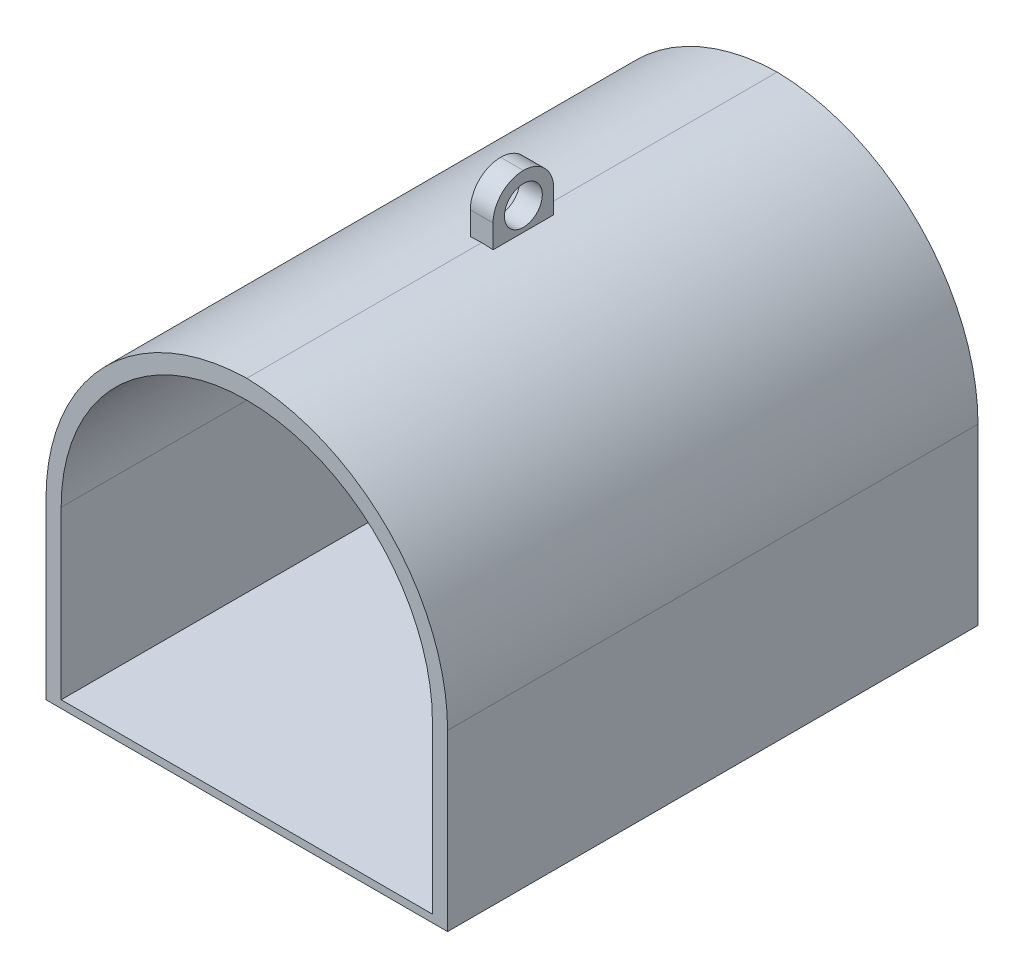
ISO-10303-21;
HEADER;
FILE_DESCRIPTION(('STEP AP214'),'2;1');
FILE_NAME('part.step','',(''),(''),'','','');
FILE_SCHEMA(('AUTOMOTIVE_DESIGN { 1 0 10303 214 1 1 1 1 }'));
ENDSEC;
DATA;
#1=APPLICATION_CONTEXT('core data for automotive mechanical design processes');
#2=APPLICATION_PROTOCOL_DEFINITION('international standard','automotive_design',2000,#1);
#3=PRODUCT_CONTEXT('',#1,'mechanical');
#4=PRODUCT('Part','Part','',(#3));
#5=PRODUCT_RELATED_PRODUCT_CATEGORY('part','',(#4));
#6=PRODUCT_DEFINITION_FORMATION('','',#4);
#7=PRODUCT_DEFINITION_CONTEXT('part definition',#1,'design');
#8=PRODUCT_DEFINITION('design','',#6,#7);
#9=PRODUCT_DEFINITION_SHAPE('','',#8);
#10=(LENGTH_UNIT() NAMED_UNIT(*) SI_UNIT(.MILLI.,.METRE.));
#11=(NAMED_UNIT(*) PLANE_ANGLE_UNIT() SI_UNIT($,.RADIAN.));
#12=(NAMED_UNIT(*) SI_UNIT($,.STERADIAN.) SOLID_ANGLE_UNIT());
#13=UNCERTAINTY_MEASURE_WITH_UNIT(LENGTH_MEASURE(1.E-05),#10,'distance_accuracy_value','');
#14=(GEOMETRIC_REPRESENTATION_CONTEXT(3) GLOBAL_UNCERTAINTY_ASSIGNED_CONTEXT((#13)) GLOBAL_UNIT_ASSIGNED_CONTEXT((#10,
#11,#12)) REPRESENTATION_CONTEXT('',''));
#15=CARTESIAN_POINT('',(0.,0.,0.));
#16=DIRECTION('',(0.,0.,1.));
#17=DIRECTION('',(1.,0.,0.));
#18=AXIS2_PLACEMENT_3D('',#15,#16,#17);
#19=CARTESIAN_POINT('',(0.,0.,70.));
#20=DIRECTION('',(1.,0.,0.));
#21=DIRECTION('',(0.,0.,-1.));
#22=AXIS2_PLACEMENT_3D('',#19,#20,#21);
#23=PLANE('',#22);
#24=DIRECTION('',(0.,-1.,0.));
#25=VECTOR('',#24,1.);
#26=CARTESIAN_POINT('',(0.,0.,70.));
#27=LINE('',#26,#25);
#28=CARTESIAN_POINT('',(0.,23.,70.));
#29=VERTEX_POINT('',#28);
#30=CARTESIAN_POINT('',(0.,0.,70.));
#31=VERTEX_POINT('',#30);
#32=EDGE_CURVE('E202',#29,#31,#27,.T.);
#33=ORIENTED_EDGE('',*,*,#32,.F.);
#34=DIRECTION('',(0.,0.,-1.));
#35=VECTOR('',#34,1.);
#36=CARTESIAN_POINT('',(0.,23.,70.));
#37=LINE('',#36,#35);
#38=CARTESIAN_POINT('',(0.,23.,0.));
#39=VERTEX_POINT('',#38);
#40=EDGE_CURVE('E233',#29,#39,#37,.T.);
#41=ORIENTED_EDGE('',*,*,#40,.T.);
#42=DIRECTION('',(0.,-1.,0.));
#43=VECTOR('',#42,1.);
#44=CARTESIAN_POINT('',(0.,0.,0.));
#45=LINE('',#44,#43);
#46=CARTESIAN_POINT('',(0.,0.,0.));
#47=VERTEX_POINT('',#46);
#48=EDGE_CURVE('E201',#39,#47,#45,.T.);
#49=ORIENTED_EDGE('',*,*,#48,.T.);
#50=DIRECTION('',(0.,0.,-1.));
#51=VECTOR('',#50,1.);
#52=CARTESIAN_POINT('',(0.,0.,70.));
#53=LINE('',#52,#51);
#54=EDGE_CURVE('E218',#31,#47,#53,.T.);
#55=ORIENTED_EDGE('',*,*,#54,.F.);
#56=EDGE_LOOP('',(#33,#41,#49,#55));
#57=FACE_BOUND('',#56,.T.);
#58=ADVANCED_FACE('F39',(#57),#23,.F.);
#59=CARTESIAN_POINT('',(0.,0.,70.));
#60=DIRECTION('',(0.,1.,0.));
#61=DIRECTION('',(0.,0.,1.));
#62=AXIS2_PLACEMENT_3D('',#59,#60,#61);
#63=PLANE('',#62);
#64=DIRECTION('',(1.,0.,0.));
#65=VECTOR('',#64,1.);
#66=CARTESIAN_POINT('',(0.,0.,0.));
#67=LINE('',#66,#65);
#68=CARTESIAN_POINT('',(53.,0.,0.));
#69=VERTEX_POINT('',#68);
#70=EDGE_CURVE('E212',#47,#69,#67,.T.);
#71=ORIENTED_EDGE('',*,*,#70,.T.);
#72=DIRECTION('',(0.,0.,-1.));
#73=VECTOR('',#72,1.);
#74=CARTESIAN_POINT('',(53.,0.,70.));
#75=LINE('',#74,#73);
#76=CARTESIAN_POINT('',(53.,0.,70.));
#77=VERTEX_POINT('',#76);
#78=EDGE_CURVE('E210',#77,#69,#75,.T.);
#79=ORIENTED_EDGE('',*,*,#78,.F.);
#80=DIRECTION('',(1.,0.,0.));
#81=VECTOR('',#80,1.);
#82=CARTESIAN_POINT('',(0.,0.,70.));
#83=LINE('',#82,#81);
#84=EDGE_CURVE('E204',#31,#77,#83,.T.);
#85=ORIENTED_EDGE('',*,*,#84,.F.);
#86=ORIENTED_EDGE('',*,*,#54,.T.);
#87=EDGE_LOOP('',(#71,#79,#85,#86));
#88=FACE_BOUND('',#87,.T.);
#89=ADVANCED_FACE('F287',(#88),#63,.F.);
#90=CARTESIAN_POINT('',(53.,0.,70.));
#91=DIRECTION('',(-1.,0.,0.));
#92=DIRECTION('',(0.,0.,1.));
#93=AXIS2_PLACEMENT_3D('',#90,#91,#92);
#94=PLANE('',#93);
#95=DIRECTION('',(0.,1.,0.));
#96=VECTOR('',#95,1.);
#97=CARTESIAN_POINT('',(53.,0.,0.));
#98=LINE('',#97,#96);
#99=CARTESIAN_POINT('',(53.,23.,0.));
#100=VERTEX_POINT('',#99);
#101=EDGE_CURVE('E205',#69,#100,#98,.T.);
#102=ORIENTED_EDGE('',*,*,#101,.T.);
#103=DIRECTION('',(0.,0.,-1.));
#104=VECTOR('',#103,1.);
#105=CARTESIAN_POINT('',(53.,23.,70.));
#106=LINE('',#105,#104);
#107=CARTESIAN_POINT('',(53.,23.,70.));
#108=VERTEX_POINT('',#107);
#109=EDGE_CURVE('E246',#100,#108,#106,.F.);
#110=ORIENTED_EDGE('',*,*,#109,.T.);
#111=DIRECTION('',(0.,1.,0.));
#112=VECTOR('',#111,1.);
#113=CARTESIAN_POINT('',(53.,0.,70.));
#114=LINE('',#113,#112);
#115=EDGE_CURVE('E207',#77,#108,#114,.T.);
#116=ORIENTED_EDGE('',*,*,#115,.F.);
#117=ORIENTED_EDGE('',*,*,#78,.T.);
#118=EDGE_LOOP('',(#102,#110,#116,#117));
#119=FACE_BOUND('',#118,.T.);
#120=ADVANCED_FACE('F282',(#119),#94,.F.);
#121=CARTESIAN_POINT('',(0.,0.,70.));
#122=DIRECTION('',(0.,0.,-1.));
#123=DIRECTION('',(-1.,0.,0.));
#124=AXIS2_PLACEMENT_3D('',#121,#122,#123);
#125=PLANE('',#124);
#126=DIRECTION('',(1.,0.,0.));
#127=VECTOR('',#126,1.);
#128=CARTESIAN_POINT('',(2.,1.,70.));
#129=LINE('',#128,#127);
#130=CARTESIAN_POINT('',(2.,1.,70.));
#131=VERTEX_POINT('',#130);
#132=CARTESIAN_POINT('',(51.,1.,70.));
#133=VERTEX_POINT('',#132);
#134=EDGE_CURVE('E177',#131,#133,#129,.T.);
#135=ORIENTED_EDGE('',*,*,#134,.F.);
#136=DIRECTION('',(0.,-1.,0.));
#137=VECTOR('',#136,1.);
#138=CARTESIAN_POINT('',(2.,1.,70.));
#139=LINE('',#138,#137);
#140=CARTESIAN_POINT('',(2.,23.,70.));
#141=VERTEX_POINT('',#140);
#142=EDGE_CURVE('E56',#141,#131,#139,.T.);
#143=ORIENTED_EDGE('',*,*,#142,.F.);
#144=CARTESIAN_POINT('',(26.5,23.,70.));
#145=DIRECTION('',(0.,0.,1.));
#146=DIRECTION('',(-1.,0.,0.));
#147=AXIS2_PLACEMENT_3D('',#144,#145,#146);
#148=CIRCLE('',#147,24.5);
#149=CARTESIAN_POINT('',(51.,23.,70.));
#150=VERTEX_POINT('',#149);
#151=EDGE_CURVE('E168',#150,#141,#148,.T.);
#152=ORIENTED_EDGE('',*,*,#151,.F.);
#153=DIRECTION('',(0.,1.,0.));
#154=VECTOR('',#153,1.);
#155=CARTESIAN_POINT('',(51.,1.,70.));
#156=LINE('',#155,#154);
#157=EDGE_CURVE('E171',#133,#150,#156,.T.);
#158=ORIENTED_EDGE('',*,*,#157,.F.);
#159=EDGE_LOOP('',(#135,#143,#152,#158));
#160=FACE_BOUND('',#159,.T.);
#161=CARTESIAN_POINT('',(26.,23.,70.));
#162=DIRECTION('',(0.,0.,-1.));
#163=DIRECTION('',(-1.,0.,0.));
#164=AXIS2_PLACEMENT_3D('',#161,#162,#163);
#165=CIRCLE('',#164,27.);
#166=CARTESIAN_POINT('',(26.5,49.9953699733862,70.));
#167=VERTEX_POINT('',#166);
#168=EDGE_CURVE('E242',#108,#167,#165,.F.);
#169=ORIENTED_EDGE('',*,*,#168,.T.);
#170=CARTESIAN_POINT('',(27.,23.,70.));
#171=DIRECTION('',(0.,0.,-1.));
#172=DIRECTION('',(-1.,0.,0.));
#173=AXIS2_PLACEMENT_3D('',#170,#171,#172);
#174=CIRCLE('',#173,27.);
#175=EDGE_CURVE('E244',#167,#29,#174,.F.);
#176=ORIENTED_EDGE('',*,*,#175,.T.);
#177=ORIENTED_EDGE('',*,*,#32,.T.);
#178=ORIENTED_EDGE('',*,*,#84,.T.);
#179=ORIENTED_EDGE('',*,*,#115,.T.);
#180=EDGE_LOOP('',(#169,#176,#177,#178,#179));
#181=FACE_BOUND('',#180,.T.);
#182=ADVANCED_FACE('F292',(#160,#181),#125,.F.);
#183=CARTESIAN_POINT('',(0.,0.,0.));
#184=DIRECTION('',(0.,0.,-1.));
#185=DIRECTION('',(-1.,0.,0.));
#186=AXIS2_PLACEMENT_3D('',#183,#184,#185);
#187=PLANE('',#186);
#188=ORIENTED_EDGE('',*,*,#48,.F.);
#189=CARTESIAN_POINT('',(27.,23.,0.));
#190=DIRECTION('',(0.,0.,-1.));
#191=DIRECTION('',(-1.,0.,0.));
#192=AXIS2_PLACEMENT_3D('',#189,#190,#191);
#193=CIRCLE('',#192,27.);
#194=CARTESIAN_POINT('',(26.5,49.9953699733862,0.));
#195=VERTEX_POINT('',#194);
#196=EDGE_CURVE('E240',#39,#195,#193,.T.);
#197=ORIENTED_EDGE('',*,*,#196,.T.);
#198=CARTESIAN_POINT('',(26.,23.,0.));
#199=DIRECTION('',(0.,0.,-1.));
#200=DIRECTION('',(-1.,0.,0.));
#201=AXIS2_PLACEMENT_3D('',#198,#199,#200);
#202=CIRCLE('',#201,27.);
#203=EDGE_CURVE('E238',#195,#100,#202,.T.);
#204=ORIENTED_EDGE('',*,*,#203,.T.);
#205=ORIENTED_EDGE('',*,*,#101,.F.);
#206=ORIENTED_EDGE('',*,*,#70,.F.);
#207=EDGE_LOOP('',(#188,#197,#204,#205,#206));
#208=FACE_BOUND('',#207,.T.);
#209=ADVANCED_FACE('F279',(#208),#187,.T.);
#210=CARTESIAN_POINT('',(28.,57.,39.));
#211=DIRECTION('',(-1.,0.,0.));
#212=DIRECTION('',(0.,0.,1.));
#213=AXIS2_PLACEMENT_3D('',#210,#211,#212);
#214=PLANE('',#213);
#215=CARTESIAN_POINT('',(28.,53.,35.));
#216=DIRECTION('',(-1.,0.,0.));
#217=DIRECTION('',(0.,0.,1.));
#218=AXIS2_PLACEMENT_3D('',#215,#216,#217);
#219=CIRCLE('',#218,2.5);
#220=CARTESIAN_POINT('',(28.,53.,37.5));
#221=VERTEX_POINT('',#220);
#222=EDGE_CURVE('E189',#221,#221,#219,.T.);
#223=ORIENTED_EDGE('',*,*,#222,.T.);
#224=EDGE_LOOP('',(#223));
#225=FACE_BOUND('',#224,.T.);
#226=DIRECTION('',(0.,-1.,0.));
#227=VECTOR('',#226,1.);
#228=CARTESIAN_POINT('',(28.,57.,31.));
#229=LINE('',#228,#227);
#230=CARTESIAN_POINT('',(28.,53.,31.));
#231=VERTEX_POINT('',#230);
#232=CARTESIAN_POINT('',(28.,49.9258240356725,31.));
#233=VERTEX_POINT('',#232);
#234=EDGE_CURVE('E63',#231,#233,#229,.T.);
#235=ORIENTED_EDGE('',*,*,#234,.F.);
#236=CARTESIAN_POINT('',(28.,53.,35.));
#237=DIRECTION('',(-1.,0.,0.));
#238=DIRECTION('',(0.,0.,1.));
#239=AXIS2_PLACEMENT_3D('',#236,#237,#238);
#240=CIRCLE('',#239,4.);
#241=CARTESIAN_POINT('',(28.,57.,35.));
#242=VERTEX_POINT('',#241);
#243=EDGE_CURVE('E229',#231,#242,#240,.F.);
#244=ORIENTED_EDGE('',*,*,#243,.T.);
#245=CARTESIAN_POINT('',(28.,53.,35.));
#246=DIRECTION('',(-1.,0.,0.));
#247=DIRECTION('',(0.,0.,1.));
#248=AXIS2_PLACEMENT_3D('',#245,#246,#247);
#249=CIRCLE('',#248,4.);
#250=CARTESIAN_POINT('',(28.,53.,39.));
#251=VERTEX_POINT('',#250);
#252=EDGE_CURVE('E227',#242,#251,#249,.F.);
#253=ORIENTED_EDGE('',*,*,#252,.T.);
#254=DIRECTION('',(0.,-1.,0.));
#255=VECTOR('',#254,1.);
#256=CARTESIAN_POINT('',(28.,57.,39.));
#257=LINE('',#256,#255);
#258=CARTESIAN_POINT('',(28.,49.9258240356725,39.));
#259=VERTEX_POINT('',#258);
#260=EDGE_CURVE('E193',#251,#259,#257,.T.);
#261=ORIENTED_EDGE('',*,*,#260,.T.);
#262=DIRECTION('',(0.,0.,-1.));
#263=VECTOR('',#262,1.);
#264=CARTESIAN_POINT('',(28.,49.9258240356725,39.));
#265=LINE('',#264,#263);
#266=EDGE_CURVE('E48',#259,#233,#265,.T.);
#267=ORIENTED_EDGE('',*,*,#266,.T.);
#268=EDGE_LOOP('',(#235,#244,#253,#261,#267));
#269=FACE_BOUND('',#268,.T.);
#270=ADVANCED_FACE('F309',(#225,#269),#214,.F.);
#271=CARTESIAN_POINT('',(25.,57.,31.));
#272=DIRECTION('',(0.,0.,1.));
#273=DIRECTION('',(1.,0.,0.));
#274=AXIS2_PLACEMENT_3D('',#271,#272,#273);
#275=PLANE('',#274);
#276=DIRECTION('',(0.,-1.,0.));
#277=VECTOR('',#276,1.);
#278=CARTESIAN_POINT('',(25.,57.,31.));
#279=LINE('',#278,#277);
#280=CARTESIAN_POINT('',(25.,53.,31.));
#281=VERTEX_POINT('',#280);
#282=CARTESIAN_POINT('',(25.,49.9258240356725,31.));
#283=VERTEX_POINT('',#282);
#284=EDGE_CURVE('E198',#281,#283,#279,.T.);
#285=ORIENTED_EDGE('',*,*,#284,.F.);
#286=DIRECTION('',(-1.,0.,0.));
#287=VECTOR('',#286,1.);
#288=CARTESIAN_POINT('',(25.,53.,31.));
#289=LINE('',#288,#287);
#290=EDGE_CURVE('E225',#281,#231,#289,.F.);
#291=ORIENTED_EDGE('',*,*,#290,.T.);
#292=ORIENTED_EDGE('',*,*,#234,.T.);
#293=CARTESIAN_POINT('',(26.,23.,31.));
#294=DIRECTION('',(0.,0.,1.));
#295=DIRECTION('',(1.,0.,0.));
#296=AXIS2_PLACEMENT_3D('',#293,#294,#295);
#297=CIRCLE('',#296,27.);
#298=CARTESIAN_POINT('',(26.5,49.9953699733862,31.));
#299=VERTEX_POINT('',#298);
#300=EDGE_CURVE('E11',#233,#299,#297,.T.);
#301=ORIENTED_EDGE('',*,*,#300,.T.);
#302=CARTESIAN_POINT('',(27.,23.,31.));
#303=DIRECTION('',(0.,0.,1.));
#304=DIRECTION('',(1.,0.,0.));
#305=AXIS2_PLACEMENT_3D('',#302,#303,#304);
#306=CIRCLE('',#305,27.);
#307=EDGE_CURVE('E248',#299,#283,#306,.T.);
#308=ORIENTED_EDGE('',*,*,#307,.T.);
#309=EDGE_LOOP('',(#285,#291,#292,#301,#308));
#310=FACE_BOUND('',#309,.T.);
#311=ADVANCED_FACE('F301',(#310),#275,.F.);
#312=CARTESIAN_POINT('',(25.,57.,39.));
#313=DIRECTION('',(1.,0.,0.));
#314=DIRECTION('',(0.,0.,-1.));
#315=AXIS2_PLACEMENT_3D('',#312,#313,#314);
#316=PLANE('',#315);
#317=CARTESIAN_POINT('',(25.,53.,35.));
#318=DIRECTION('',(-1.,0.,0.));
#319=DIRECTION('',(0.,0.,1.));
#320=AXIS2_PLACEMENT_3D('',#317,#318,#319);
#321=CIRCLE('',#320,2.5);
#322=CARTESIAN_POINT('',(25.,53.,37.5));
#323=VERTEX_POINT('',#322);
#324=EDGE_CURVE('E183',#323,#323,#321,.T.);
#325=ORIENTED_EDGE('',*,*,#324,.F.);
#326=EDGE_LOOP('',(#325));
#327=FACE_BOUND('',#326,.T.);
#328=CARTESIAN_POINT('',(25.,53.,35.));
#329=DIRECTION('',(1.,0.,0.));
#330=DIRECTION('',(0.,0.,-1.));
#331=AXIS2_PLACEMENT_3D('',#328,#329,#330);
#332=CIRCLE('',#331,4.);
#333=CARTESIAN_POINT('',(25.,53.,39.));
#334=VERTEX_POINT('',#333);
#335=CARTESIAN_POINT('',(25.,57.,35.));
#336=VERTEX_POINT('',#335);
#337=EDGE_CURVE('E221',#334,#336,#332,.F.);
#338=ORIENTED_EDGE('',*,*,#337,.T.);
#339=CARTESIAN_POINT('',(25.,53.,35.));
#340=DIRECTION('',(1.,0.,0.));
#341=DIRECTION('',(0.,0.,-1.));
#342=AXIS2_PLACEMENT_3D('',#339,#340,#341);
#343=CIRCLE('',#342,4.);
#344=EDGE_CURVE('E223',#336,#281,#343,.F.);
#345=ORIENTED_EDGE('',*,*,#344,.T.);
#346=ORIENTED_EDGE('',*,*,#284,.T.);
#347=DIRECTION('',(0.,0.,-1.));
#348=VECTOR('',#347,1.);
#349=CARTESIAN_POINT('',(25.,49.9258240356725,31.));
#350=LINE('',#349,#348);
#351=CARTESIAN_POINT('',(25.,49.9258240356725,39.));
#352=VERTEX_POINT('',#351);
#353=EDGE_CURVE('E251',#283,#352,#350,.F.);
#354=ORIENTED_EDGE('',*,*,#353,.T.);
#355=DIRECTION('',(0.,-1.,0.));
#356=VECTOR('',#355,1.);
#357=CARTESIAN_POINT('',(25.,57.,39.));
#358=LINE('',#357,#356);
#359=EDGE_CURVE('E195',#334,#352,#358,.T.);
#360=ORIENTED_EDGE('',*,*,#359,.F.);
#361=EDGE_LOOP('',(#338,#345,#346,#354,#360));
#362=FACE_BOUND('',#361,.T.);
#363=ADVANCED_FACE('F313',(#327,#362),#316,.F.);
#364=CARTESIAN_POINT('',(25.,57.,39.));
#365=DIRECTION('',(0.,0.,-1.));
#366=DIRECTION('',(-1.,0.,0.));
#367=AXIS2_PLACEMENT_3D('',#364,#365,#366);
#368=PLANE('',#367);
#369=ORIENTED_EDGE('',*,*,#260,.F.);
#370=DIRECTION('',(1.,0.,0.));
#371=VECTOR('',#370,1.);
#372=CARTESIAN_POINT('',(25.,53.,39.));
#373=LINE('',#372,#371);
#374=EDGE_CURVE('E231',#251,#334,#373,.F.);
#375=ORIENTED_EDGE('',*,*,#374,.T.);
#376=ORIENTED_EDGE('',*,*,#359,.T.);
#377=CARTESIAN_POINT('',(27.,23.,39.));
#378=DIRECTION('',(0.,0.,-1.));
#379=DIRECTION('',(-1.,0.,0.));
#380=AXIS2_PLACEMENT_3D('',#377,#378,#379);
#381=CIRCLE('',#380,27.);
#382=CARTESIAN_POINT('',(26.5,49.9953699733862,39.));
#383=VERTEX_POINT('',#382);
#384=EDGE_CURVE('E254',#352,#383,#381,.T.);
#385=ORIENTED_EDGE('',*,*,#384,.T.);
#386=CARTESIAN_POINT('',(26.,23.,39.));
#387=DIRECTION('',(0.,0.,-1.));
#388=DIRECTION('',(-1.,0.,0.));
#389=AXIS2_PLACEMENT_3D('',#386,#387,#388);
#390=CIRCLE('',#389,27.);
#391=EDGE_CURVE('E256',#383,#259,#390,.T.);
#392=ORIENTED_EDGE('',*,*,#391,.T.);
#393=EDGE_LOOP('',(#369,#375,#376,#385,#392));
#394=FACE_BOUND('',#393,.T.);
#395=ADVANCED_FACE('F296',(#394),#368,.F.);
#396=CARTESIAN_POINT('',(0.,53.,35.));
#397=DIRECTION('',(1.,0.,0.));
#398=DIRECTION('',(0.,0.,-1.));
#399=AXIS2_PLACEMENT_3D('',#396,#397,#398);
#400=CYLINDRICAL_SURFACE('',#399,4.);
#401=ORIENTED_EDGE('',*,*,#374,.F.);
#402=ORIENTED_EDGE('',*,*,#252,.F.);
#403=DIRECTION('',(1.,0.,0.));
#404=VECTOR('',#403,1.);
#405=CARTESIAN_POINT('',(0.,57.,35.));
#406=LINE('',#405,#404);
#407=EDGE_CURVE('E196',#336,#242,#406,.T.);
#408=ORIENTED_EDGE('',*,*,#407,.F.);
#409=ORIENTED_EDGE('',*,*,#337,.F.);
#410=EDGE_LOOP('',(#401,#402,#408,#409));
#411=FACE_BOUND('',#410,.T.);
#412=ADVANCED_FACE('F311',(#411),#400,.T.);
#413=CARTESIAN_POINT('',(0.,53.,35.));
#414=DIRECTION('',(-1.,0.,0.));
#415=DIRECTION('',(0.,0.,1.));
#416=AXIS2_PLACEMENT_3D('',#413,#414,#415);
#417=CYLINDRICAL_SURFACE('',#416,4.);
#418=ORIENTED_EDGE('',*,*,#243,.F.);
#419=ORIENTED_EDGE('',*,*,#290,.F.);
#420=ORIENTED_EDGE('',*,*,#344,.F.);
#421=ORIENTED_EDGE('',*,*,#407,.T.);
#422=EDGE_LOOP('',(#418,#419,#420,#421));
#423=FACE_BOUND('',#422,.T.);
#424=ADVANCED_FACE('F305',(#423),#417,.T.);
#425=CARTESIAN_POINT('',(26.,23.,70.));
#426=DIRECTION('',(0.,0.,-1.));
#427=DIRECTION('',(-1.,0.,0.));
#428=AXIS2_PLACEMENT_3D('',#425,#426,#427);
#429=CYLINDRICAL_SURFACE('',#428,27.);
#430=DIRECTION('',(0.,0.,-1.));
#431=VECTOR('',#430,1.);
#432=CARTESIAN_POINT('',(26.5,49.9953699733862,35.));
#433=LINE('',#432,#431);
#434=EDGE_CURVE('E43',#299,#195,#433,.T.);
#435=ORIENTED_EDGE('',*,*,#434,.F.);
#436=ORIENTED_EDGE('',*,*,#300,.F.);
#437=ORIENTED_EDGE('',*,*,#266,.F.);
#438=ORIENTED_EDGE('',*,*,#391,.F.);
#439=DIRECTION('',(0.,0.,-1.));
#440=VECTOR('',#439,1.);
#441=CARTESIAN_POINT('',(26.5,49.9953699733862,35.));
#442=LINE('',#441,#440);
#443=EDGE_CURVE('E192',#167,#383,#442,.T.);
#444=ORIENTED_EDGE('',*,*,#443,.F.);
#445=ORIENTED_EDGE('',*,*,#168,.F.);
#446=ORIENTED_EDGE('',*,*,#109,.F.);
#447=ORIENTED_EDGE('',*,*,#203,.F.);
#448=EDGE_LOOP('',(#435,#436,#437,#438,#444,#445,#446,#447));
#449=FACE_BOUND('',#448,.T.);
#450=ADVANCED_FACE('F41',(#449),#429,.T.);
#451=CARTESIAN_POINT('',(27.,23.,70.));
#452=DIRECTION('',(0.,0.,-1.));
#453=DIRECTION('',(-1.,0.,0.));
#454=AXIS2_PLACEMENT_3D('',#451,#452,#453);
#455=CYLINDRICAL_SURFACE('',#454,27.);
#456=ORIENTED_EDGE('',*,*,#307,.F.);
#457=ORIENTED_EDGE('',*,*,#434,.T.);
#458=ORIENTED_EDGE('',*,*,#196,.F.);
#459=ORIENTED_EDGE('',*,*,#40,.F.);
#460=ORIENTED_EDGE('',*,*,#175,.F.);
#461=ORIENTED_EDGE('',*,*,#443,.T.);
#462=ORIENTED_EDGE('',*,*,#384,.F.);
#463=ORIENTED_EDGE('',*,*,#353,.F.);
#464=EDGE_LOOP('',(#456,#457,#458,#459,#460,#461,#462,#463));
#465=FACE_BOUND('',#464,.T.);
#466=ADVANCED_FACE('F267',(#465),#455,.T.);
#467=CARTESIAN_POINT('',(32.,53.,35.));
#468=DIRECTION('',(-1.,0.,0.));
#469=DIRECTION('',(0.,0.,1.));
#470=AXIS2_PLACEMENT_3D('',#467,#468,#469);
#471=CYLINDRICAL_SURFACE('',#470,2.5);
#472=ORIENTED_EDGE('',*,*,#324,.T.);
#473=EDGE_LOOP('',(#472));
#474=FACE_BOUND('',#473,.T.);
#475=ORIENTED_EDGE('',*,*,#222,.F.);
#476=EDGE_LOOP('',(#475));
#477=FACE_BOUND('',#476,.T.);
#478=ADVANCED_FACE('F336',(#474,#477),#471,.F.);
#479=CARTESIAN_POINT('',(2.,1.,2.));
#480=DIRECTION('',(-1.,0.,0.));
#481=DIRECTION('',(0.,0.,1.));
#482=AXIS2_PLACEMENT_3D('',#479,#480,#481);
#483=PLANE('',#482);
#484=ORIENTED_EDGE('',*,*,#142,.T.);
#485=DIRECTION('',(0.,0.,1.));
#486=VECTOR('',#485,1.);
#487=CARTESIAN_POINT('',(2.,1.,2.));
#488=LINE('',#487,#486);
#489=CARTESIAN_POINT('',(2.,1.,2.));
#490=VERTEX_POINT('',#489);
#491=EDGE_CURVE('E146',#490,#131,#488,.T.);
#492=ORIENTED_EDGE('',*,*,#491,.F.);
#493=DIRECTION('',(0.,-1.,0.));
#494=VECTOR('',#493,1.);
#495=CARTESIAN_POINT('',(2.,1.,2.));
#496=LINE('',#495,#494);
#497=CARTESIAN_POINT('',(2.,23.,2.));
#498=VERTEX_POINT('',#497);
#499=EDGE_CURVE('E150',#498,#490,#496,.T.);
#500=ORIENTED_EDGE('',*,*,#499,.F.);
#501=DIRECTION('',(0.,0.,1.));
#502=VECTOR('',#501,1.);
#503=CARTESIAN_POINT('',(2.,23.,2.));
#504=LINE('',#503,#502);
#505=EDGE_CURVE('E181',#498,#141,#504,.T.);
#506=ORIENTED_EDGE('',*,*,#505,.T.);
#507=EDGE_LOOP('',(#484,#492,#500,#506));
#508=FACE_BOUND('',#507,.T.);
#509=ADVANCED_FACE('F148',(#508),#483,.F.);
#510=CARTESIAN_POINT('',(26.5,23.,2.));
#511=DIRECTION('',(0.,0.,1.));
#512=DIRECTION('',(1.,0.,0.));
#513=AXIS2_PLACEMENT_3D('',#510,#511,#512);
#514=CYLINDRICAL_SURFACE('',#513,24.5);
#515=ORIENTED_EDGE('',*,*,#151,.T.);
#516=ORIENTED_EDGE('',*,*,#505,.F.);
#517=CARTESIAN_POINT('',(26.5,23.,2.));
#518=DIRECTION('',(0.,0.,1.));
#519=DIRECTION('',(-1.,0.,0.));
#520=AXIS2_PLACEMENT_3D('',#517,#518,#519);
#521=CIRCLE('',#520,24.5);
#522=CARTESIAN_POINT('',(51.,23.,2.));
#523=VERTEX_POINT('',#522);
#524=EDGE_CURVE('E155',#523,#498,#521,.T.);
#525=ORIENTED_EDGE('',*,*,#524,.F.);
#526=DIRECTION('',(0.,0.,1.));
#527=VECTOR('',#526,1.);
#528=CARTESIAN_POINT('',(51.,23.,2.));
#529=LINE('',#528,#527);
#530=EDGE_CURVE('E184',#523,#150,#529,.T.);
#531=ORIENTED_EDGE('',*,*,#530,.T.);
#532=EDGE_LOOP('',(#515,#516,#525,#531));
#533=FACE_BOUND('',#532,.T.);
#534=ADVANCED_FACE('F455',(#533),#514,.F.);
#535=CARTESIAN_POINT('',(51.,1.,2.));
#536=DIRECTION('',(1.,0.,0.));
#537=DIRECTION('',(0.,0.,-1.));
#538=AXIS2_PLACEMENT_3D('',#535,#536,#537);
#539=PLANE('',#538);
#540=ORIENTED_EDGE('',*,*,#157,.T.);
#541=ORIENTED_EDGE('',*,*,#530,.F.);
#542=DIRECTION('',(0.,1.,0.));
#543=VECTOR('',#542,1.);
#544=CARTESIAN_POINT('',(51.,1.,2.));
#545=LINE('',#544,#543);
#546=CARTESIAN_POINT('',(51.,1.,2.));
#547=VERTEX_POINT('',#546);
#548=EDGE_CURVE('E163',#547,#523,#545,.T.);
#549=ORIENTED_EDGE('',*,*,#548,.F.);
#550=DIRECTION('',(0.,0.,1.));
#551=VECTOR('',#550,1.);
#552=CARTESIAN_POINT('',(51.,1.,2.));
#553=LINE('',#552,#551);
#554=EDGE_CURVE('E154',#547,#133,#553,.T.);
#555=ORIENTED_EDGE('',*,*,#554,.T.);
#556=EDGE_LOOP('',(#540,#541,#549,#555));
#557=FACE_BOUND('',#556,.T.);
#558=ADVANCED_FACE('F464',(#557),#539,.F.);
#559=CARTESIAN_POINT('',(2.,1.,2.));
#560=DIRECTION('',(0.,-1.,0.));
#561=DIRECTION('',(0.,0.,-1.));
#562=AXIS2_PLACEMENT_3D('',#559,#560,#561);
#563=PLANE('',#562);
#564=ORIENTED_EDGE('',*,*,#134,.T.);
#565=ORIENTED_EDGE('',*,*,#554,.F.);
#566=DIRECTION('',(1.,0.,0.));
#567=VECTOR('',#566,1.);
#568=CARTESIAN_POINT('',(2.,1.,2.));
#569=LINE('',#568,#567);
#570=EDGE_CURVE('E158',#490,#547,#569,.T.);
#571=ORIENTED_EDGE('',*,*,#570,.F.);
#572=ORIENTED_EDGE('',*,*,#491,.T.);
#573=EDGE_LOOP('',(#564,#565,#571,#572));
#574=FACE_BOUND('',#573,.T.);
#575=ADVANCED_FACE('F159',(#574),#563,.F.);
#576=CARTESIAN_POINT('',(26.5,23.,2.));
#577=DIRECTION('',(0.,0.,-1.));
#578=DIRECTION('',(-1.,0.,0.));
#579=AXIS2_PLACEMENT_3D('',#576,#577,#578);
#580=PLANE('',#579);
#581=ORIENTED_EDGE('',*,*,#499,.T.);
#582=ORIENTED_EDGE('',*,*,#570,.T.);
#583=ORIENTED_EDGE('',*,*,#548,.T.);
#584=ORIENTED_EDGE('',*,*,#524,.T.);
#585=EDGE_LOOP('',(#581,#582,#583,#584));
#586=FACE_BOUND('',#585,.T.);
#587=ADVANCED_FACE('F165',(#586),#580,.F.);
#588=CLOSED_SHELL('',(#58,#89,#120,#182,#209,#270,#311,#363,#395,#412,#424,#450,#466,#478,#509,
#534,#558,#575,#587));
#589=MANIFOLD_SOLID_BREP('B2',#588);
#590=ADVANCED_BREP_SHAPE_REPRESENTATION('',(#18,#589),#14);
#591=SHAPE_DEFINITION_REPRESENTATION(#9,#590);
ENDSEC;
END-ISO-10303-21;
